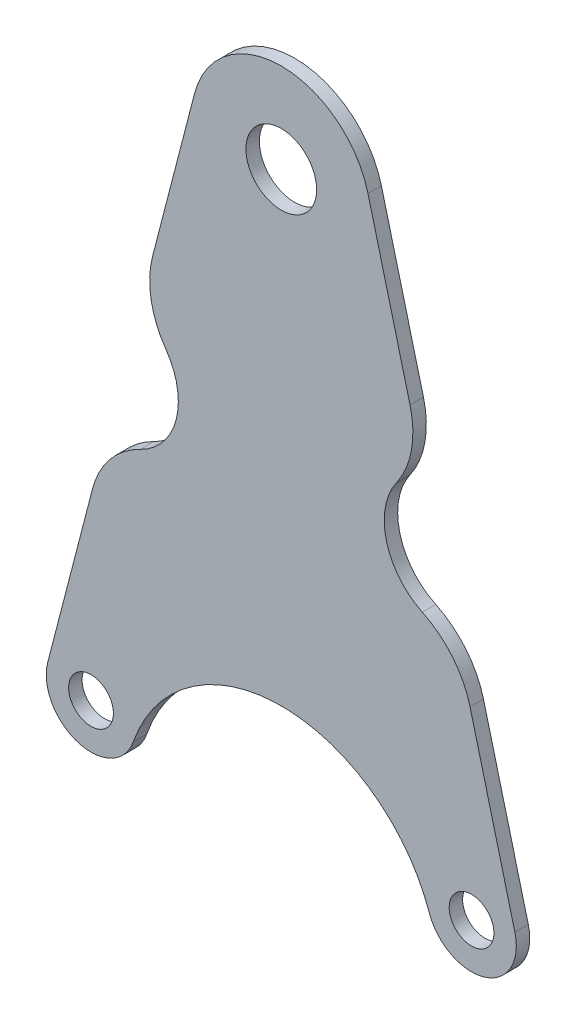
ISO-10303-21;
HEADER;
FILE_DESCRIPTION(('STEP AP214'),'2;1');
FILE_NAME('part.step','',(''),(''),'','','');
FILE_SCHEMA(('AUTOMOTIVE_DESIGN { 1 0 10303 214 1 1 1 1 }'));
ENDSEC;
DATA;
#1=APPLICATION_CONTEXT('core data for automotive mechanical design processes');
#2=APPLICATION_PROTOCOL_DEFINITION('international standard','automotive_design',2000,#1);
#3=PRODUCT_CONTEXT('',#1,'mechanical');
#4=PRODUCT('Part','Part','',(#3));
#5=PRODUCT_RELATED_PRODUCT_CATEGORY('part','',(#4));
#6=PRODUCT_DEFINITION_FORMATION('','',#4);
#7=PRODUCT_DEFINITION_CONTEXT('part definition',#1,'design');
#8=PRODUCT_DEFINITION('design','',#6,#7);
#9=PRODUCT_DEFINITION_SHAPE('','',#8);
#10=(LENGTH_UNIT() NAMED_UNIT(*) SI_UNIT(.MILLI.,.METRE.));
#11=(NAMED_UNIT(*) PLANE_ANGLE_UNIT() SI_UNIT($,.RADIAN.));
#12=(NAMED_UNIT(*) SI_UNIT($,.STERADIAN.) SOLID_ANGLE_UNIT());
#13=UNCERTAINTY_MEASURE_WITH_UNIT(LENGTH_MEASURE(1.E-05),#10,'distance_accuracy_value','');
#14=(GEOMETRIC_REPRESENTATION_CONTEXT(3) GLOBAL_UNCERTAINTY_ASSIGNED_CONTEXT((#13)) GLOBAL_UNIT_ASSIGNED_CONTEXT((#10,
#11,#12)) REPRESENTATION_CONTEXT('',''));
#15=CARTESIAN_POINT('',(0.,0.,0.));
#16=DIRECTION('',(0.,0.,1.));
#17=DIRECTION('',(1.,0.,0.));
#18=AXIS2_PLACEMENT_3D('',#15,#16,#17);
#19=CARTESIAN_POINT('',(19.3591481337917,5.02228867488829,3.));
#20=DIRECTION('',(-0.967957406689584,-0.251114433744414,0.));
#21=DIRECTION('',(0.251114433744413,-0.967957406689584,0.));
#22=AXIS2_PLACEMENT_3D('',#19,#20,#21);
#23=PLANE('',#22);
#24=DIRECTION('',(-0.251114433744413,0.967957406689584,0.));
#25=VECTOR('',#24,1.);
#26=CARTESIAN_POINT('',(19.3591481337917,5.02228867488829,0.));
#27=LINE('',#26,#25);
#28=CARTESIAN_POINT('',(52.1795740668958,-121.488855662556,0.));
#29=VERTEX_POINT('',#28);
#30=CARTESIAN_POINT('',(42.1688366722787,-82.9010004642103,0.));
#31=VERTEX_POINT('',#30);
#32=EDGE_CURVE('E240',#29,#31,#27,.T.);
#33=ORIENTED_EDGE('',*,*,#32,.T.);
#34=DIRECTION('',(0.,0.,1.));
#35=VECTOR('',#34,1.);
#36=CARTESIAN_POINT('',(42.1688366722787,-82.9010004642103,3.));
#37=LINE('',#36,#35);
#38=CARTESIAN_POINT('',(42.1688366722787,-82.9010004642103,3.));
#39=VERTEX_POINT('',#38);
#40=EDGE_CURVE('E178',#31,#39,#37,.T.);
#41=ORIENTED_EDGE('',*,*,#40,.T.);
#42=DIRECTION('',(-0.251114433744413,0.967957406689584,0.));
#43=VECTOR('',#42,1.);
#44=CARTESIAN_POINT('',(19.3591481337917,5.02228867488829,3.));
#45=LINE('',#44,#43);
#46=CARTESIAN_POINT('',(52.1795740668958,-121.488855662556,3.));
#47=VERTEX_POINT('',#46);
#48=EDGE_CURVE('E294',#47,#39,#45,.T.);
#49=ORIENTED_EDGE('',*,*,#48,.F.);
#50=DIRECTION('',(0.,0.,-1.));
#51=VECTOR('',#50,1.);
#52=CARTESIAN_POINT('',(52.1795740668958,-121.488855662556,3.));
#53=LINE('',#52,#51);
#54=EDGE_CURVE('E158',#47,#29,#53,.T.);
#55=ORIENTED_EDGE('',*,*,#54,.T.);
#56=EDGE_LOOP('',(#33,#41,#49,#55));
#57=FACE_BOUND('',#56,.T.);
#58=ADVANCED_FACE('F48',(#57),#23,.F.);
#59=CARTESIAN_POINT('',(-19.3591481337917,5.02228867488827,3.));
#60=DIRECTION('',(0.967957406689583,-0.251114433744413,0.));
#61=DIRECTION('',(0.251114433744414,0.967957406689584,0.));
#62=AXIS2_PLACEMENT_3D('',#59,#60,#61);
#63=PLANE('',#62);
#64=DIRECTION('',(-0.251114433744414,-0.967957406689584,0.));
#65=VECTOR('',#64,1.);
#66=CARTESIAN_POINT('',(-19.3591481337917,5.02228867488827,0.));
#67=LINE('',#66,#65);
#68=CARTESIAN_POINT('',(-19.3591481337917,5.02228867488827,0.));
#69=VERTEX_POINT('',#68);
#70=CARTESIAN_POINT('',(-28.7558438062362,-31.1986526661746,0.));
#71=VERTEX_POINT('',#70);
#72=EDGE_CURVE('E236',#69,#71,#67,.T.);
#73=ORIENTED_EDGE('',*,*,#72,.T.);
#74=DIRECTION('',(0.,0.,1.));
#75=VECTOR('',#74,1.);
#76=CARTESIAN_POINT('',(-28.7558438062362,-31.1986526661746,3.));
#77=LINE('',#76,#75);
#78=CARTESIAN_POINT('',(-28.7558438062362,-31.1986526661746,3.));
#79=VERTEX_POINT('',#78);
#80=EDGE_CURVE('E13',#71,#79,#77,.T.);
#81=ORIENTED_EDGE('',*,*,#80,.T.);
#82=DIRECTION('',(-0.251114433744414,-0.967957406689584,0.));
#83=VECTOR('',#82,1.);
#84=CARTESIAN_POINT('',(-19.3591481337917,5.02228867488827,3.));
#85=LINE('',#84,#83);
#86=CARTESIAN_POINT('',(-19.3591481337917,5.02228867488827,3.));
#87=VERTEX_POINT('',#86);
#88=EDGE_CURVE('E297',#87,#79,#85,.T.);
#89=ORIENTED_EDGE('',*,*,#88,.F.);
#90=DIRECTION('',(0.,0.,-1.));
#91=VECTOR('',#90,1.);
#92=CARTESIAN_POINT('',(-19.3591481337917,5.02228867488827,3.));
#93=LINE('',#92,#91);
#94=EDGE_CURVE('E249',#87,#69,#93,.T.);
#95=ORIENTED_EDGE('',*,*,#94,.T.);
#96=EDGE_LOOP('',(#73,#81,#89,#95));
#97=FACE_BOUND('',#96,.T.);
#98=ADVANCED_FACE('F267',(#97),#63,.F.);
#99=CARTESIAN_POINT('',(0.,-138.790199457749,3.));
#100=DIRECTION('',(0.,0.,-1.));
#101=DIRECTION('',(-1.,0.,0.));
#102=AXIS2_PLACEMENT_3D('',#99,#100,#101);
#103=PLANE('',#102);
#104=ORIENTED_EDGE('',*,*,#48,.T.);
#105=CARTESIAN_POINT('',(22.8096885384871,-87.9232891390986,3.));
#106=DIRECTION('',(0.,0.,-1.));
#107=DIRECTION('',(-1.,0.,0.));
#108=AXIS2_PLACEMENT_3D('',#105,#106,#107);
#109=CIRCLE('',#108,20.);
#110=CARTESIAN_POINT('',(31.4898665164945,-69.905117470749,3.));
#111=VERTEX_POINT('',#110);
#112=EDGE_CURVE('E192',#39,#111,#109,.F.);
#113=ORIENTED_EDGE('',*,*,#112,.T.);
#114=CARTESIAN_POINT('',(38.,-56.3914887194868,3.));
#115=DIRECTION('',(0.,0.,1.));
#116=DIRECTION('',(-1.,0.,0.));
#117=AXIS2_PLACEMENT_3D('',#114,#115,#116);
#118=CIRCLE('',#117,15.);
#119=CARTESIAN_POINT('',(25.7414410024762,-47.746968414448,3.));
#120=VERTEX_POINT('',#119);
#121=EDGE_CURVE('E277',#120,#111,#118,.T.);
#122=ORIENTED_EDGE('',*,*,#121,.F.);
#123=CARTESIAN_POINT('',(9.39669567244449,-36.2209413410628,3.));
#124=DIRECTION('',(0.,0.,-1.));
#125=DIRECTION('',(-1.,0.,0.));
#126=AXIS2_PLACEMENT_3D('',#123,#124,#125);
#127=CIRCLE('',#126,20.);
#128=CARTESIAN_POINT('',(28.7558438062362,-31.1986526661745,3.));
#129=VERTEX_POINT('',#128);
#130=EDGE_CURVE('E190',#120,#129,#127,.F.);
#131=ORIENTED_EDGE('',*,*,#130,.T.);
#132=CARTESIAN_POINT('',(19.3591481337917,5.02228867488829,3.));
#133=VERTEX_POINT('',#132);
#134=EDGE_CURVE('E162',#129,#133,#45,.T.);
#135=ORIENTED_EDGE('',*,*,#134,.T.);
#136=CARTESIAN_POINT('',(0.,0.,3.));
#137=DIRECTION('',(0.,0.,1.));
#138=DIRECTION('',(-1.,0.,0.));
#139=AXIS2_PLACEMENT_3D('',#136,#137,#138);
#140=CIRCLE('',#139,20.);
#141=EDGE_CURVE('E258',#133,#87,#140,.T.);
#142=ORIENTED_EDGE('',*,*,#141,.T.);
#143=ORIENTED_EDGE('',*,*,#88,.T.);
#144=CARTESIAN_POINT('',(-9.39669567244452,-36.2209413410629,3.));
#145=DIRECTION('',(0.,0.,-1.));
#146=DIRECTION('',(-1.,0.,0.));
#147=AXIS2_PLACEMENT_3D('',#144,#145,#146);
#148=CIRCLE('',#147,20.);
#149=CARTESIAN_POINT('',(-25.7414410024762,-47.746968414448,3.));
#150=VERTEX_POINT('',#149);
#151=EDGE_CURVE('E181',#79,#150,#148,.F.);
#152=ORIENTED_EDGE('',*,*,#151,.T.);
#153=CARTESIAN_POINT('',(-38.,-56.3914887194868,3.));
#154=DIRECTION('',(0.,0.,1.));
#155=DIRECTION('',(1.,0.,0.));
#156=AXIS2_PLACEMENT_3D('',#153,#154,#155);
#157=CIRCLE('',#156,15.);
#158=CARTESIAN_POINT('',(-31.4898665164945,-69.905117470749,3.));
#159=VERTEX_POINT('',#158);
#160=EDGE_CURVE('E214',#159,#150,#157,.T.);
#161=ORIENTED_EDGE('',*,*,#160,.F.);
#162=CARTESIAN_POINT('',(-22.8096885384871,-87.9232891390986,3.));
#163=DIRECTION('',(0.,0.,-1.));
#164=DIRECTION('',(-1.,0.,0.));
#165=AXIS2_PLACEMENT_3D('',#162,#163,#164);
#166=CIRCLE('',#165,20.);
#167=CARTESIAN_POINT('',(-42.1688366722788,-82.9010004642103,3.));
#168=VERTEX_POINT('',#167);
#169=EDGE_CURVE('E188',#159,#168,#166,.F.);
#170=ORIENTED_EDGE('',*,*,#169,.T.);
#171=CARTESIAN_POINT('',(-52.1795740668959,-121.488855662556,3.));
#172=VERTEX_POINT('',#171);
#173=EDGE_CURVE('E230',#168,#172,#85,.T.);
#174=ORIENTED_EDGE('',*,*,#173,.T.);
#175=CARTESIAN_POINT('',(-42.5000000000001,-124.,3.));
#176=DIRECTION('',(0.,0.,1.));
#177=DIRECTION('',(1.,0.,0.));
#178=AXIS2_PLACEMENT_3D('',#175,#176,#177);
#179=CIRCLE('',#178,10.);
#180=CARTESIAN_POINT('',(-33.0555555555556,-127.286710990611,3.));
#181=VERTEX_POINT('',#180);
#182=EDGE_CURVE('E169',#172,#181,#179,.T.);
#183=ORIENTED_EDGE('',*,*,#182,.T.);
#184=CARTESIAN_POINT('',(0.,-138.790199457749,3.));
#185=DIRECTION('',(0.,0.,-1.));
#186=DIRECTION('',(-1.,0.,0.));
#187=AXIS2_PLACEMENT_3D('',#184,#185,#186);
#188=CIRCLE('',#187,35.);
#189=CARTESIAN_POINT('',(33.0555555555556,-127.286710990611,3.));
#190=VERTEX_POINT('',#189);
#191=EDGE_CURVE('E163',#181,#190,#188,.T.);
#192=ORIENTED_EDGE('',*,*,#191,.T.);
#193=CARTESIAN_POINT('',(42.5,-124.,3.));
#194=DIRECTION('',(0.,0.,1.));
#195=DIRECTION('',(-1.,0.,0.));
#196=AXIS2_PLACEMENT_3D('',#193,#194,#195);
#197=CIRCLE('',#196,9.99999999999999);
#198=EDGE_CURVE('E151',#190,#47,#197,.T.);
#199=ORIENTED_EDGE('',*,*,#198,.T.);
#200=EDGE_LOOP('',(#104,#113,#122,#131,#135,#142,#143,#152,#161,#170,#174,#183,#192,#199));
#201=FACE_BOUND('',#200,.T.);
#202=CARTESIAN_POINT('',(0.,0.,3.));
#203=DIRECTION('',(0.,0.,1.));
#204=DIRECTION('',(1.,0.,0.));
#205=AXIS2_PLACEMENT_3D('',#202,#203,#204);
#206=CIRCLE('',#205,7.9);
#207=CARTESIAN_POINT('',(7.90000000000001,0.,3.));
#208=VERTEX_POINT('',#207);
#209=EDGE_CURVE('E289',#208,#208,#206,.T.);
#210=ORIENTED_EDGE('',*,*,#209,.F.);
#211=EDGE_LOOP('',(#210));
#212=FACE_BOUND('',#211,.T.);
#213=CARTESIAN_POINT('',(-42.5000000000001,-124.,3.));
#214=DIRECTION('',(0.,0.,1.));
#215=DIRECTION('',(1.,0.,0.));
#216=AXIS2_PLACEMENT_3D('',#213,#214,#215);
#217=CIRCLE('',#216,5.00000000000001);
#218=CARTESIAN_POINT('',(-37.5000000000001,-124.,3.));
#219=VERTEX_POINT('',#218);
#220=EDGE_CURVE('E283',#219,#219,#217,.T.);
#221=ORIENTED_EDGE('',*,*,#220,.F.);
#222=EDGE_LOOP('',(#221));
#223=FACE_BOUND('',#222,.T.);
#224=CARTESIAN_POINT('',(42.5,-124.,3.));
#225=DIRECTION('',(0.,0.,1.));
#226=DIRECTION('',(-1.,0.,0.));
#227=AXIS2_PLACEMENT_3D('',#224,#225,#226);
#228=CIRCLE('',#227,5.);
#229=CARTESIAN_POINT('',(37.5,-124.,3.));
#230=VERTEX_POINT('',#229);
#231=EDGE_CURVE('E273',#230,#230,#228,.T.);
#232=ORIENTED_EDGE('',*,*,#231,.F.);
#233=EDGE_LOOP('',(#232));
#234=FACE_BOUND('',#233,.T.);
#235=ADVANCED_FACE('F166',(#201,#212,#223,#234),#103,.F.);
#236=CARTESIAN_POINT('',(0.,-138.790199457749,0.));
#237=DIRECTION('',(0.,0.,-1.));
#238=DIRECTION('',(-1.,0.,0.));
#239=AXIS2_PLACEMENT_3D('',#236,#237,#238);
#240=PLANE('',#239);
#241=CARTESIAN_POINT('',(38.,-56.3914887194868,0.));
#242=DIRECTION('',(0.,0.,1.));
#243=DIRECTION('',(-1.,0.,0.));
#244=AXIS2_PLACEMENT_3D('',#241,#242,#243);
#245=CIRCLE('',#244,15.);
#246=CARTESIAN_POINT('',(25.7414410024762,-47.746968414448,0.));
#247=VERTEX_POINT('',#246);
#248=CARTESIAN_POINT('',(31.4898665164945,-69.905117470749,0.));
#249=VERTEX_POINT('',#248);
#250=EDGE_CURVE('E221',#247,#249,#245,.T.);
#251=ORIENTED_EDGE('',*,*,#250,.T.);
#252=CARTESIAN_POINT('',(22.8096885384871,-87.9232891390986,0.));
#253=DIRECTION('',(0.,0.,-1.));
#254=DIRECTION('',(-1.,0.,0.));
#255=AXIS2_PLACEMENT_3D('',#252,#253,#254);
#256=CIRCLE('',#255,20.);
#257=EDGE_CURVE('E202',#249,#31,#256,.T.);
#258=ORIENTED_EDGE('',*,*,#257,.T.);
#259=ORIENTED_EDGE('',*,*,#32,.F.);
#260=CARTESIAN_POINT('',(42.5,-124.,0.));
#261=DIRECTION('',(0.,0.,1.));
#262=DIRECTION('',(-1.,0.,0.));
#263=AXIS2_PLACEMENT_3D('',#260,#261,#262);
#264=CIRCLE('',#263,9.99999999999999);
#265=CARTESIAN_POINT('',(33.0555555555556,-127.286710990611,0.));
#266=VERTEX_POINT('',#265);
#267=EDGE_CURVE('E301',#266,#29,#264,.T.);
#268=ORIENTED_EDGE('',*,*,#267,.F.);
#269=CARTESIAN_POINT('',(0.,-138.790199457749,0.));
#270=DIRECTION('',(0.,0.,-1.));
#271=DIRECTION('',(-1.,0.,0.));
#272=AXIS2_PLACEMENT_3D('',#269,#270,#271);
#273=CIRCLE('',#272,35.);
#274=CARTESIAN_POINT('',(-33.0555555555556,-127.286710990611,0.));
#275=VERTEX_POINT('',#274);
#276=EDGE_CURVE('E177',#275,#266,#273,.T.);
#277=ORIENTED_EDGE('',*,*,#276,.F.);
#278=CARTESIAN_POINT('',(-42.5000000000001,-124.,0.));
#279=DIRECTION('',(0.,0.,1.));
#280=DIRECTION('',(1.,0.,0.));
#281=AXIS2_PLACEMENT_3D('',#278,#279,#280);
#282=CIRCLE('',#281,10.);
#283=CARTESIAN_POINT('',(-52.1795740668959,-121.488855662556,0.));
#284=VERTEX_POINT('',#283);
#285=EDGE_CURVE('E173',#284,#275,#282,.T.);
#286=ORIENTED_EDGE('',*,*,#285,.F.);
#287=CARTESIAN_POINT('',(-42.1688366722788,-82.9010004642103,0.));
#288=VERTEX_POINT('',#287);
#289=EDGE_CURVE('E228',#288,#284,#67,.T.);
#290=ORIENTED_EDGE('',*,*,#289,.F.);
#291=CARTESIAN_POINT('',(-22.8096885384871,-87.9232891390986,0.));
#292=DIRECTION('',(0.,0.,-1.));
#293=DIRECTION('',(-1.,0.,0.));
#294=AXIS2_PLACEMENT_3D('',#291,#292,#293);
#295=CIRCLE('',#294,20.);
#296=CARTESIAN_POINT('',(-31.4898665164945,-69.905117470749,0.));
#297=VERTEX_POINT('',#296);
#298=EDGE_CURVE('E63',#288,#297,#295,.T.);
#299=ORIENTED_EDGE('',*,*,#298,.T.);
#300=CARTESIAN_POINT('',(-38.,-56.3914887194868,0.));
#301=DIRECTION('',(0.,0.,1.));
#302=DIRECTION('',(1.,0.,0.));
#303=AXIS2_PLACEMENT_3D('',#300,#301,#302);
#304=CIRCLE('',#303,15.);
#305=CARTESIAN_POINT('',(-25.7414410024762,-47.746968414448,0.));
#306=VERTEX_POINT('',#305);
#307=EDGE_CURVE('E217',#297,#306,#304,.T.);
#308=ORIENTED_EDGE('',*,*,#307,.T.);
#309=CARTESIAN_POINT('',(-9.39669567244452,-36.2209413410629,0.));
#310=DIRECTION('',(0.,0.,-1.));
#311=DIRECTION('',(-1.,0.,0.));
#312=AXIS2_PLACEMENT_3D('',#309,#310,#311);
#313=CIRCLE('',#312,20.);
#314=EDGE_CURVE('E198',#306,#71,#313,.T.);
#315=ORIENTED_EDGE('',*,*,#314,.T.);
#316=ORIENTED_EDGE('',*,*,#72,.F.);
#317=CARTESIAN_POINT('',(0.,0.,0.));
#318=DIRECTION('',(0.,0.,1.));
#319=DIRECTION('',(-1.,0.,0.));
#320=AXIS2_PLACEMENT_3D('',#317,#318,#319);
#321=CIRCLE('',#320,20.);
#322=CARTESIAN_POINT('',(19.3591481337917,5.02228867488829,0.));
#323=VERTEX_POINT('',#322);
#324=EDGE_CURVE('E237',#323,#69,#321,.T.);
#325=ORIENTED_EDGE('',*,*,#324,.F.);
#326=CARTESIAN_POINT('',(28.7558438062362,-31.1986526661745,0.));
#327=VERTEX_POINT('',#326);
#328=EDGE_CURVE('E263',#327,#323,#27,.T.);
#329=ORIENTED_EDGE('',*,*,#328,.F.);
#330=CARTESIAN_POINT('',(9.39669567244449,-36.2209413410628,0.));
#331=DIRECTION('',(0.,0.,-1.));
#332=DIRECTION('',(-1.,0.,0.));
#333=AXIS2_PLACEMENT_3D('',#330,#331,#332);
#334=CIRCLE('',#333,20.);
#335=EDGE_CURVE('E71',#327,#247,#334,.T.);
#336=ORIENTED_EDGE('',*,*,#335,.T.);
#337=EDGE_LOOP('',(#251,#258,#259,#268,#277,#286,#290,#299,#308,#315,#316,#325,#329,#336));
#338=FACE_BOUND('',#337,.T.);
#339=CARTESIAN_POINT('',(-42.5000000000001,-124.,0.));
#340=DIRECTION('',(0.,0.,1.));
#341=DIRECTION('',(1.,0.,0.));
#342=AXIS2_PLACEMENT_3D('',#339,#340,#341);
#343=CIRCLE('',#342,5.00000000000001);
#344=CARTESIAN_POINT('',(-37.5000000000001,-124.,0.));
#345=VERTEX_POINT('',#344);
#346=EDGE_CURVE('E281',#345,#345,#343,.T.);
#347=ORIENTED_EDGE('',*,*,#346,.T.);
#348=EDGE_LOOP('',(#347));
#349=FACE_BOUND('',#348,.T.);
#350=CARTESIAN_POINT('',(0.,0.,0.));
#351=DIRECTION('',(0.,0.,1.));
#352=DIRECTION('',(1.,0.,0.));
#353=AXIS2_PLACEMENT_3D('',#350,#351,#352);
#354=CIRCLE('',#353,7.9);
#355=CARTESIAN_POINT('',(7.90000000000001,0.,0.));
#356=VERTEX_POINT('',#355);
#357=EDGE_CURVE('E286',#356,#356,#354,.T.);
#358=ORIENTED_EDGE('',*,*,#357,.T.);
#359=EDGE_LOOP('',(#358));
#360=FACE_BOUND('',#359,.T.);
#361=CARTESIAN_POINT('',(42.5,-124.,0.));
#362=DIRECTION('',(0.,0.,1.));
#363=DIRECTION('',(-1.,0.,0.));
#364=AXIS2_PLACEMENT_3D('',#361,#362,#363);
#365=CIRCLE('',#364,5.);
#366=CARTESIAN_POINT('',(37.5,-124.,0.));
#367=VERTEX_POINT('',#366);
#368=EDGE_CURVE('E270',#367,#367,#365,.T.);
#369=ORIENTED_EDGE('',*,*,#368,.T.);
#370=EDGE_LOOP('',(#369));
#371=FACE_BOUND('',#370,.T.);
#372=ADVANCED_FACE('F234',(#338,#349,#360,#371),#240,.T.);
#373=CARTESIAN_POINT('',(0.,-138.790199457749,3.));
#374=DIRECTION('',(0.,0.,-1.));
#375=DIRECTION('',(-1.,0.,0.));
#376=AXIS2_PLACEMENT_3D('',#373,#374,#375);
#377=CYLINDRICAL_SURFACE('',#376,35.);
#378=ORIENTED_EDGE('',*,*,#276,.T.);
#379=DIRECTION('',(0.,0.,-1.));
#380=VECTOR('',#379,1.);
#381=CARTESIAN_POINT('',(33.0555555555556,-127.286710990611,3.));
#382=LINE('',#381,#380);
#383=EDGE_CURVE('E155',#190,#266,#382,.T.);
#384=ORIENTED_EDGE('',*,*,#383,.F.);
#385=ORIENTED_EDGE('',*,*,#191,.F.);
#386=DIRECTION('',(0.,0.,-1.));
#387=VECTOR('',#386,1.);
#388=CARTESIAN_POINT('',(-33.0555555555556,-127.286710990611,3.));
#389=LINE('',#388,#387);
#390=EDGE_CURVE('E245',#181,#275,#389,.T.);
#391=ORIENTED_EDGE('',*,*,#390,.T.);
#392=EDGE_LOOP('',(#378,#384,#385,#391));
#393=FACE_BOUND('',#392,.T.);
#394=ADVANCED_FACE('F175',(#393),#377,.F.);
#395=CARTESIAN_POINT('',(42.5,-124.,3.));
#396=DIRECTION('',(0.,0.,-1.));
#397=DIRECTION('',(-1.,0.,0.));
#398=AXIS2_PLACEMENT_3D('',#395,#396,#397);
#399=CYLINDRICAL_SURFACE('',#398,9.99999999999999);
#400=ORIENTED_EDGE('',*,*,#267,.T.);
#401=ORIENTED_EDGE('',*,*,#54,.F.);
#402=ORIENTED_EDGE('',*,*,#198,.F.);
#403=ORIENTED_EDGE('',*,*,#383,.T.);
#404=EDGE_LOOP('',(#400,#401,#402,#403));
#405=FACE_BOUND('',#404,.T.);
#406=ADVANCED_FACE('F153',(#405),#399,.T.);
#407=ORIENTED_EDGE('',*,*,#134,.F.);
#408=DIRECTION('',(0.,0.,1.));
#409=VECTOR('',#408,1.);
#410=CARTESIAN_POINT('',(28.7558438062362,-31.1986526661746,3.));
#411=LINE('',#410,#409);
#412=EDGE_CURVE('E204',#129,#327,#411,.F.);
#413=ORIENTED_EDGE('',*,*,#412,.T.);
#414=ORIENTED_EDGE('',*,*,#328,.T.);
#415=DIRECTION('',(0.,0.,-1.));
#416=VECTOR('',#415,1.);
#417=CARTESIAN_POINT('',(19.3591481337917,5.02228867488829,3.));
#418=LINE('',#417,#416);
#419=EDGE_CURVE('E183',#133,#323,#418,.T.);
#420=ORIENTED_EDGE('',*,*,#419,.F.);
#421=EDGE_LOOP('',(#407,#413,#414,#420));
#422=FACE_BOUND('',#421,.T.);
#423=ADVANCED_FACE('F306',(#422),#23,.F.);
#424=CARTESIAN_POINT('',(0.,0.,3.));
#425=DIRECTION('',(0.,0.,-1.));
#426=DIRECTION('',(-1.,0.,0.));
#427=AXIS2_PLACEMENT_3D('',#424,#425,#426);
#428=CYLINDRICAL_SURFACE('',#427,20.);
#429=ORIENTED_EDGE('',*,*,#324,.T.);
#430=ORIENTED_EDGE('',*,*,#94,.F.);
#431=ORIENTED_EDGE('',*,*,#141,.F.);
#432=ORIENTED_EDGE('',*,*,#419,.T.);
#433=EDGE_LOOP('',(#429,#430,#431,#432));
#434=FACE_BOUND('',#433,.T.);
#435=ADVANCED_FACE('F256',(#434),#428,.T.);
#436=ORIENTED_EDGE('',*,*,#173,.F.);
#437=DIRECTION('',(0.,0.,1.));
#438=VECTOR('',#437,1.);
#439=CARTESIAN_POINT('',(-42.1688366722788,-82.9010004642103,3.));
#440=LINE('',#439,#438);
#441=EDGE_CURVE('E206',#168,#288,#440,.F.);
#442=ORIENTED_EDGE('',*,*,#441,.T.);
#443=ORIENTED_EDGE('',*,*,#289,.T.);
#444=DIRECTION('',(0.,0.,-1.));
#445=VECTOR('',#444,1.);
#446=CARTESIAN_POINT('',(-52.1795740668959,-121.488855662556,3.));
#447=LINE('',#446,#445);
#448=EDGE_CURVE('E247',#172,#284,#447,.T.);
#449=ORIENTED_EDGE('',*,*,#448,.F.);
#450=EDGE_LOOP('',(#436,#442,#443,#449));
#451=FACE_BOUND('',#450,.T.);
#452=ADVANCED_FACE('F226',(#451),#63,.F.);
#453=CARTESIAN_POINT('',(-42.5000000000001,-124.,3.));
#454=DIRECTION('',(0.,0.,-1.));
#455=DIRECTION('',(-1.,0.,0.));
#456=AXIS2_PLACEMENT_3D('',#453,#454,#455);
#457=CYLINDRICAL_SURFACE('',#456,10.);
#458=ORIENTED_EDGE('',*,*,#285,.T.);
#459=ORIENTED_EDGE('',*,*,#390,.F.);
#460=ORIENTED_EDGE('',*,*,#182,.F.);
#461=ORIENTED_EDGE('',*,*,#448,.T.);
#462=EDGE_LOOP('',(#458,#459,#460,#461));
#463=FACE_BOUND('',#462,.T.);
#464=ADVANCED_FACE('F397',(#463),#457,.T.);
#465=CARTESIAN_POINT('',(0.,0.,3.));
#466=DIRECTION('',(0.,0.,-1.));
#467=DIRECTION('',(-1.,0.,0.));
#468=AXIS2_PLACEMENT_3D('',#465,#466,#467);
#469=CYLINDRICAL_SURFACE('',#468,7.9);
#470=ORIENTED_EDGE('',*,*,#209,.T.);
#471=EDGE_LOOP('',(#470));
#472=FACE_BOUND('',#471,.T.);
#473=ORIENTED_EDGE('',*,*,#357,.F.);
#474=EDGE_LOOP('',(#473));
#475=FACE_BOUND('',#474,.T.);
#476=ADVANCED_FACE('F389',(#472,#475),#469,.F.);
#477=CARTESIAN_POINT('',(-42.5000000000001,-124.,3.));
#478=DIRECTION('',(0.,0.,-1.));
#479=DIRECTION('',(-1.,0.,0.));
#480=AXIS2_PLACEMENT_3D('',#477,#478,#479);
#481=CYLINDRICAL_SURFACE('',#480,5.00000000000001);
#482=ORIENTED_EDGE('',*,*,#220,.T.);
#483=EDGE_LOOP('',(#482));
#484=FACE_BOUND('',#483,.T.);
#485=ORIENTED_EDGE('',*,*,#346,.F.);
#486=EDGE_LOOP('',(#485));
#487=FACE_BOUND('',#486,.T.);
#488=ADVANCED_FACE('F381',(#484,#487),#481,.F.);
#489=CARTESIAN_POINT('',(42.5,-124.,3.));
#490=DIRECTION('',(0.,0.,-1.));
#491=DIRECTION('',(-1.,0.,0.));
#492=AXIS2_PLACEMENT_3D('',#489,#490,#491);
#493=CYLINDRICAL_SURFACE('',#492,5.);
#494=ORIENTED_EDGE('',*,*,#231,.T.);
#495=EDGE_LOOP('',(#494));
#496=FACE_BOUND('',#495,.T.);
#497=ORIENTED_EDGE('',*,*,#368,.F.);
#498=EDGE_LOOP('',(#497));
#499=FACE_BOUND('',#498,.T.);
#500=ADVANCED_FACE('F366',(#496,#499),#493,.F.);
#501=CARTESIAN_POINT('',(-38.,-56.3914887194868,0.));
#502=DIRECTION('',(0.,0.,1.));
#503=DIRECTION('',(1.,0.,0.));
#504=AXIS2_PLACEMENT_3D('',#501,#502,#503);
#505=CYLINDRICAL_SURFACE('',#504,15.);
#506=ORIENTED_EDGE('',*,*,#307,.F.);
#507=DIRECTION('',(0.,0.,1.));
#508=VECTOR('',#507,1.);
#509=CARTESIAN_POINT('',(-31.4898665164945,-69.905117470749,0.));
#510=LINE('',#509,#508);
#511=EDGE_CURVE('E56',#297,#159,#510,.T.);
#512=ORIENTED_EDGE('',*,*,#511,.T.);
#513=ORIENTED_EDGE('',*,*,#160,.T.);
#514=DIRECTION('',(0.,0.,1.));
#515=VECTOR('',#514,1.);
#516=CARTESIAN_POINT('',(-25.7414410024763,-47.746968414448,0.));
#517=LINE('',#516,#515);
#518=EDGE_CURVE('E208',#150,#306,#517,.F.);
#519=ORIENTED_EDGE('',*,*,#518,.T.);
#520=EDGE_LOOP('',(#506,#512,#513,#519));
#521=FACE_BOUND('',#520,.T.);
#522=ADVANCED_FACE('F213',(#521),#505,.F.);
#523=CARTESIAN_POINT('',(38.,-56.3914887194868,0.));
#524=DIRECTION('',(0.,0.,1.));
#525=DIRECTION('',(1.,0.,0.));
#526=AXIS2_PLACEMENT_3D('',#523,#524,#525);
#527=CYLINDRICAL_SURFACE('',#526,15.);
#528=ORIENTED_EDGE('',*,*,#121,.T.);
#529=DIRECTION('',(0.,0.,1.));
#530=VECTOR('',#529,1.);
#531=CARTESIAN_POINT('',(31.4898665164945,-69.905117470749,0.));
#532=LINE('',#531,#530);
#533=EDGE_CURVE('E196',#111,#249,#532,.F.);
#534=ORIENTED_EDGE('',*,*,#533,.T.);
#535=ORIENTED_EDGE('',*,*,#250,.F.);
#536=DIRECTION('',(0.,0.,1.));
#537=VECTOR('',#536,1.);
#538=CARTESIAN_POINT('',(25.7414410024762,-47.746968414448,0.));
#539=LINE('',#538,#537);
#540=EDGE_CURVE('E194',#247,#120,#539,.T.);
#541=ORIENTED_EDGE('',*,*,#540,.T.);
#542=EDGE_LOOP('',(#528,#534,#535,#541));
#543=FACE_BOUND('',#542,.T.);
#544=ADVANCED_FACE('F312',(#543),#527,.F.);
#545=CARTESIAN_POINT('',(22.8096885384871,-87.9232891390986,0.));
#546=DIRECTION('',(0.,0.,1.));
#547=DIRECTION('',(1.,0.,0.));
#548=AXIS2_PLACEMENT_3D('',#545,#546,#547);
#549=CYLINDRICAL_SURFACE('',#548,20.);
#550=ORIENTED_EDGE('',*,*,#257,.F.);
#551=ORIENTED_EDGE('',*,*,#533,.F.);
#552=ORIENTED_EDGE('',*,*,#112,.F.);
#553=ORIENTED_EDGE('',*,*,#40,.F.);
#554=EDGE_LOOP('',(#550,#551,#552,#553));
#555=FACE_BOUND('',#554,.T.);
#556=ADVANCED_FACE('F316',(#555),#549,.T.);
#557=CARTESIAN_POINT('',(9.39669567244449,-36.2209413410628,0.));
#558=DIRECTION('',(0.,0.,1.));
#559=DIRECTION('',(1.,0.,0.));
#560=AXIS2_PLACEMENT_3D('',#557,#558,#559);
#561=CYLINDRICAL_SURFACE('',#560,20.);
#562=ORIENTED_EDGE('',*,*,#130,.F.);
#563=ORIENTED_EDGE('',*,*,#540,.F.);
#564=ORIENTED_EDGE('',*,*,#335,.F.);
#565=ORIENTED_EDGE('',*,*,#412,.F.);
#566=EDGE_LOOP('',(#562,#563,#564,#565));
#567=FACE_BOUND('',#566,.T.);
#568=ADVANCED_FACE('F308',(#567),#561,.T.);
#569=CARTESIAN_POINT('',(-22.8096885384871,-87.9232891390986,0.));
#570=DIRECTION('',(0.,0.,1.));
#571=DIRECTION('',(1.,0.,0.));
#572=AXIS2_PLACEMENT_3D('',#569,#570,#571);
#573=CYLINDRICAL_SURFACE('',#572,20.);
#574=ORIENTED_EDGE('',*,*,#169,.F.);
#575=ORIENTED_EDGE('',*,*,#511,.F.);
#576=ORIENTED_EDGE('',*,*,#298,.F.);
#577=ORIENTED_EDGE('',*,*,#441,.F.);
#578=EDGE_LOOP('',(#574,#575,#576,#577));
#579=FACE_BOUND('',#578,.T.);
#580=ADVANCED_FACE('F223',(#579),#573,.T.);
#581=CARTESIAN_POINT('',(-9.39669567244452,-36.2209413410629,0.));
#582=DIRECTION('',(0.,0.,1.));
#583=DIRECTION('',(1.,0.,0.));
#584=AXIS2_PLACEMENT_3D('',#581,#582,#583);
#585=CYLINDRICAL_SURFACE('',#584,20.);
#586=ORIENTED_EDGE('',*,*,#314,.F.);
#587=ORIENTED_EDGE('',*,*,#518,.F.);
#588=ORIENTED_EDGE('',*,*,#151,.F.);
#589=ORIENTED_EDGE('',*,*,#80,.F.);
#590=EDGE_LOOP('',(#586,#587,#588,#589));
#591=FACE_BOUND('',#590,.T.);
#592=ADVANCED_FACE('F50',(#591),#585,.T.);
#593=CLOSED_SHELL('',(#58,#98,#235,#372,#394,#406,#423,#435,#452,#464,#476,#488,#500,#522,#544,
#556,#568,#580,#592));
#594=MANIFOLD_SOLID_BREP('B2',#593);
#595=ADVANCED_BREP_SHAPE_REPRESENTATION('',(#18,#594),#14);
#596=SHAPE_DEFINITION_REPRESENTATION(#9,#595);
ENDSEC;
END-ISO-10303-21;
